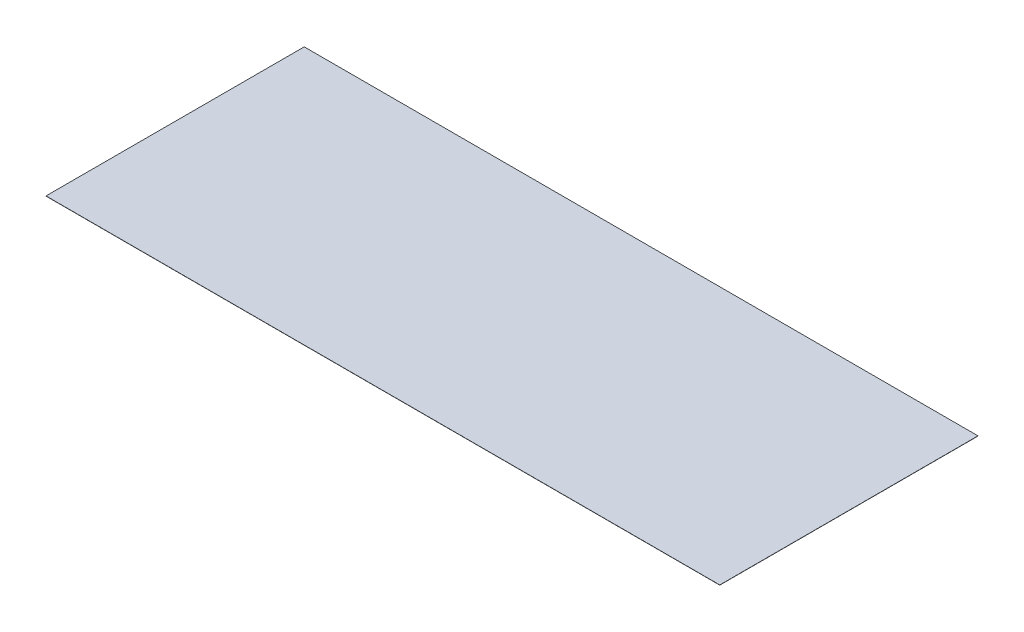
ISO-10303-21;
HEADER;
FILE_DESCRIPTION(('STEP AP214'),'2;1');
FILE_NAME('part.step','',(''),(''),'','','');
FILE_SCHEMA(('AUTOMOTIVE_DESIGN { 1 0 10303 214 1 1 1 1 }'));
ENDSEC;
DATA;
#1=APPLICATION_CONTEXT('core data for automotive mechanical design processes');
#2=APPLICATION_PROTOCOL_DEFINITION('international standard','automotive_design',2000,#1);
#3=PRODUCT_CONTEXT('',#1,'mechanical');
#4=PRODUCT('Part','Part','',(#3));
#5=PRODUCT_RELATED_PRODUCT_CATEGORY('part','',(#4));
#6=PRODUCT_DEFINITION_FORMATION('','',#4);
#7=PRODUCT_DEFINITION_CONTEXT('part definition',#1,'design');
#8=PRODUCT_DEFINITION('design','',#6,#7);
#9=PRODUCT_DEFINITION_SHAPE('','',#8);
#10=(LENGTH_UNIT() NAMED_UNIT(*) SI_UNIT(.MILLI.,.METRE.));
#11=(NAMED_UNIT(*) PLANE_ANGLE_UNIT() SI_UNIT($,.RADIAN.));
#12=(NAMED_UNIT(*) SI_UNIT($,.STERADIAN.) SOLID_ANGLE_UNIT());
#13=UNCERTAINTY_MEASURE_WITH_UNIT(LENGTH_MEASURE(1.E-05),#10,'distance_accuracy_value','');
#14=(GEOMETRIC_REPRESENTATION_CONTEXT(3) GLOBAL_UNCERTAINTY_ASSIGNED_CONTEXT((#13)) GLOBAL_UNIT_ASSIGNED_CONTEXT((#10,
#11,#12)) REPRESENTATION_CONTEXT('',''));
#15=CARTESIAN_POINT('',(0.,0.,0.));
#16=DIRECTION('',(0.,0.,1.));
#17=DIRECTION('',(1.,0.,0.));
#18=AXIS2_PLACEMENT_3D('',#15,#16,#17);
#19=CARTESIAN_POINT('',(2743.2,1.5875,1051.306));
#20=DIRECTION('',(-1.,0.,0.));
#21=DIRECTION('',(0.,0.,1.));
#22=AXIS2_PLACEMENT_3D('',#19,#20,#21);
#23=PLANE('',#22);
#24=DIRECTION('',(0.,0.,-1.));
#25=VECTOR('',#24,1.);
#26=CARTESIAN_POINT('',(2743.2,0.,1051.306));
#27=LINE('',#26,#25);
#28=CARTESIAN_POINT('',(2743.2,0.,1051.306));
#29=VERTEX_POINT('',#28);
#30=CARTESIAN_POINT('',(2743.2,0.,-1051.306));
#31=VERTEX_POINT('',#30);
#32=EDGE_CURVE('E100',#29,#31,#27,.T.);
#33=ORIENTED_EDGE('',*,*,#32,.T.);
#34=DIRECTION('',(0.,-1.,0.));
#35=VECTOR('',#34,1.);
#36=CARTESIAN_POINT('',(2743.2,1.5875,-1051.306));
#37=LINE('',#36,#35);
#38=CARTESIAN_POINT('',(2743.2,1.5875,-1051.306));
#39=VERTEX_POINT('',#38);
#40=EDGE_CURVE('E11',#39,#31,#37,.T.);
#41=ORIENTED_EDGE('',*,*,#40,.F.);
#42=DIRECTION('',(0.,0.,-1.));
#43=VECTOR('',#42,1.);
#44=CARTESIAN_POINT('',(2743.2,1.5875,1051.306));
#45=LINE('',#44,#43);
#46=CARTESIAN_POINT('',(2743.2,1.5875,1051.306));
#47=VERTEX_POINT('',#46);
#48=EDGE_CURVE('E88',#47,#39,#45,.T.);
#49=ORIENTED_EDGE('',*,*,#48,.F.);
#50=DIRECTION('',(0.,-1.,0.));
#51=VECTOR('',#50,1.);
#52=CARTESIAN_POINT('',(2743.2,1.5875,1051.306));
#53=LINE('',#52,#51);
#54=EDGE_CURVE('E96',#47,#29,#53,.T.);
#55=ORIENTED_EDGE('',*,*,#54,.T.);
#56=EDGE_LOOP('',(#33,#41,#49,#55));
#57=FACE_BOUND('',#56,.T.);
#58=ADVANCED_FACE('F37',(#57),#23,.F.);
#59=CARTESIAN_POINT('',(-2743.2,1.5875,-1051.306));
#60=DIRECTION('',(0.,0.,1.));
#61=DIRECTION('',(1.,0.,0.));
#62=AXIS2_PLACEMENT_3D('',#59,#60,#61);
#63=PLANE('',#62);
#64=DIRECTION('',(-1.,0.,0.));
#65=VECTOR('',#64,1.);
#66=CARTESIAN_POINT('',(-2743.2,0.,-1051.306));
#67=LINE('',#66,#65);
#68=CARTESIAN_POINT('',(-2743.2,0.,-1051.306));
#69=VERTEX_POINT('',#68);
#70=EDGE_CURVE('E92',#31,#69,#67,.T.);
#71=ORIENTED_EDGE('',*,*,#70,.T.);
#72=DIRECTION('',(0.,-1.,0.));
#73=VECTOR('',#72,1.);
#74=CARTESIAN_POINT('',(-2743.2,1.5875,-1051.306));
#75=LINE('',#74,#73);
#76=CARTESIAN_POINT('',(-2743.2,1.5875,-1051.306));
#77=VERTEX_POINT('',#76);
#78=EDGE_CURVE('E45',#77,#69,#75,.T.);
#79=ORIENTED_EDGE('',*,*,#78,.F.);
#80=DIRECTION('',(-1.,0.,0.));
#81=VECTOR('',#80,1.);
#82=CARTESIAN_POINT('',(-2743.2,1.5875,-1051.306));
#83=LINE('',#82,#81);
#84=EDGE_CURVE('E83',#39,#77,#83,.T.);
#85=ORIENTED_EDGE('',*,*,#84,.F.);
#86=ORIENTED_EDGE('',*,*,#40,.T.);
#87=EDGE_LOOP('',(#71,#79,#85,#86));
#88=FACE_BOUND('',#87,.T.);
#89=ADVANCED_FACE('F91',(#88),#63,.F.);
#90=CARTESIAN_POINT('',(-2743.2,1.5875,1051.306));
#91=DIRECTION('',(1.,0.,0.));
#92=DIRECTION('',(0.,0.,-1.));
#93=AXIS2_PLACEMENT_3D('',#90,#91,#92);
#94=PLANE('',#93);
#95=DIRECTION('',(0.,0.,1.));
#96=VECTOR('',#95,1.);
#97=CARTESIAN_POINT('',(-2743.2,0.,1051.306));
#98=LINE('',#97,#96);
#99=CARTESIAN_POINT('',(-2743.2,0.,1051.306));
#100=VERTEX_POINT('',#99);
#101=EDGE_CURVE('E70',#69,#100,#98,.T.);
#102=ORIENTED_EDGE('',*,*,#101,.T.);
#103=DIRECTION('',(0.,-1.,0.));
#104=VECTOR('',#103,1.);
#105=CARTESIAN_POINT('',(-2743.2,1.5875,1051.306));
#106=LINE('',#105,#104);
#107=CARTESIAN_POINT('',(-2743.2,1.5875,1051.306));
#108=VERTEX_POINT('',#107);
#109=EDGE_CURVE('E93',#108,#100,#106,.T.);
#110=ORIENTED_EDGE('',*,*,#109,.F.);
#111=DIRECTION('',(0.,0.,1.));
#112=VECTOR('',#111,1.);
#113=CARTESIAN_POINT('',(-2743.2,1.5875,1051.306));
#114=LINE('',#113,#112);
#115=EDGE_CURVE('E86',#77,#108,#114,.T.);
#116=ORIENTED_EDGE('',*,*,#115,.F.);
#117=ORIENTED_EDGE('',*,*,#78,.T.);
#118=EDGE_LOOP('',(#102,#110,#116,#117));
#119=FACE_BOUND('',#118,.T.);
#120=ADVANCED_FACE('F94',(#119),#94,.F.);
#121=CARTESIAN_POINT('',(-2743.2,1.5875,1051.306));
#122=DIRECTION('',(0.,0.,-1.));
#123=DIRECTION('',(-1.,0.,0.));
#124=AXIS2_PLACEMENT_3D('',#121,#122,#123);
#125=PLANE('',#124);
#126=DIRECTION('',(1.,0.,0.));
#127=VECTOR('',#126,1.);
#128=CARTESIAN_POINT('',(-2743.2,0.,1051.306));
#129=LINE('',#128,#127);
#130=EDGE_CURVE('E76',#100,#29,#129,.T.);
#131=ORIENTED_EDGE('',*,*,#130,.T.);
#132=ORIENTED_EDGE('',*,*,#54,.F.);
#133=DIRECTION('',(1.,0.,0.));
#134=VECTOR('',#133,1.);
#135=CARTESIAN_POINT('',(-2743.2,1.5875,1051.306));
#136=LINE('',#135,#134);
#137=EDGE_CURVE('E53',#108,#47,#136,.T.);
#138=ORIENTED_EDGE('',*,*,#137,.F.);
#139=ORIENTED_EDGE('',*,*,#109,.T.);
#140=EDGE_LOOP('',(#131,#132,#138,#139));
#141=FACE_BOUND('',#140,.T.);
#142=ADVANCED_FACE('F107',(#141),#125,.F.);
#143=CARTESIAN_POINT('',(0.,1.5875,0.));
#144=DIRECTION('',(0.,-1.,0.));
#145=DIRECTION('',(0.,0.,-1.));
#146=AXIS2_PLACEMENT_3D('',#143,#144,#145);
#147=PLANE('',#146);
#148=ORIENTED_EDGE('',*,*,#48,.T.);
#149=ORIENTED_EDGE('',*,*,#84,.T.);
#150=ORIENTED_EDGE('',*,*,#115,.T.);
#151=ORIENTED_EDGE('',*,*,#137,.T.);
#152=EDGE_LOOP('',(#148,#149,#150,#151));
#153=FACE_BOUND('',#152,.T.);
#154=ADVANCED_FACE('F84',(#153),#147,.F.);
#155=CARTESIAN_POINT('',(0.,0.,0.));
#156=DIRECTION('',(0.,-1.,0.));
#157=DIRECTION('',(0.,0.,-1.));
#158=AXIS2_PLACEMENT_3D('',#155,#156,#157);
#159=PLANE('',#158);
#160=ORIENTED_EDGE('',*,*,#32,.F.);
#161=ORIENTED_EDGE('',*,*,#130,.F.);
#162=ORIENTED_EDGE('',*,*,#101,.F.);
#163=ORIENTED_EDGE('',*,*,#70,.F.);
#164=EDGE_LOOP('',(#160,#161,#162,#163));
#165=FACE_BOUND('',#164,.T.);
#166=ADVANCED_FACE('F110',(#165),#159,.T.);
#167=CLOSED_SHELL('',(#58,#89,#120,#142,#154,#166));
#168=MANIFOLD_SOLID_BREP('B2',#167);
#169=ADVANCED_BREP_SHAPE_REPRESENTATION('',(#18,#168),#14);
#170=SHAPE_DEFINITION_REPRESENTATION(#9,#169);
ENDSEC;
END-ISO-10303-21;
